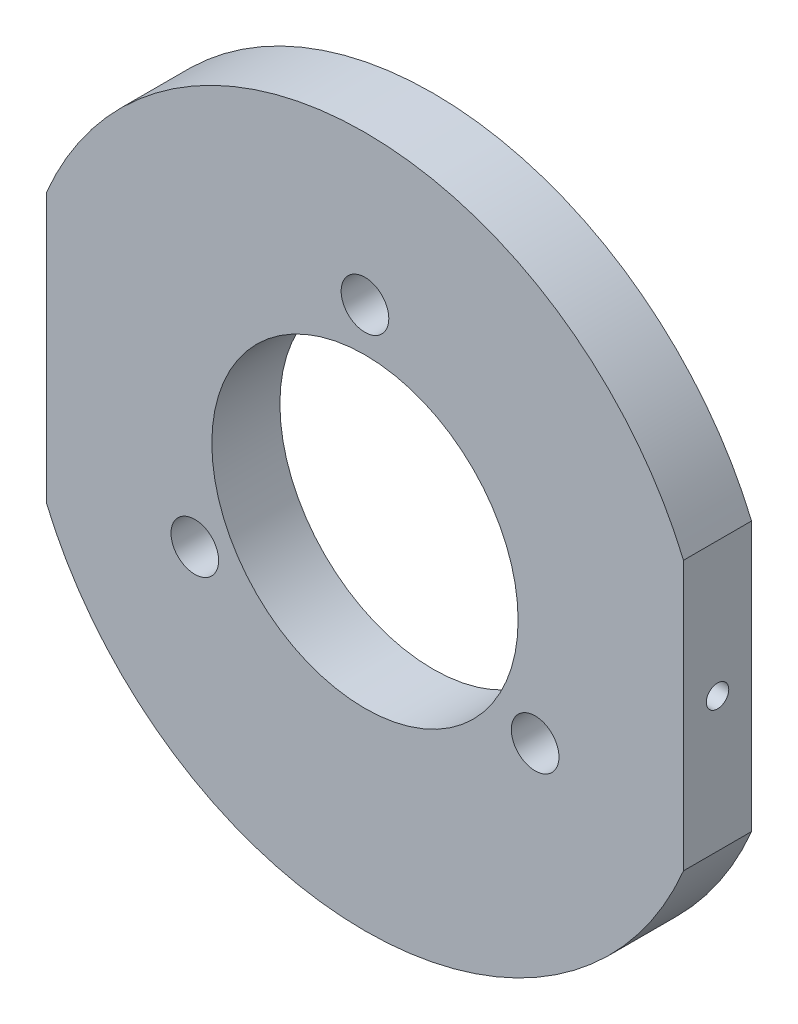
ISO-10303-21;
HEADER;
FILE_DESCRIPTION(('STEP AP214'),'2;1');
FILE_NAME('part.step','',(''),(''),'','','');
FILE_SCHEMA(('AUTOMOTIVE_DESIGN { 1 0 10303 214 1 1 1 1 }'));
ENDSEC;
DATA;
#1=APPLICATION_CONTEXT('core data for automotive mechanical design processes');
#2=APPLICATION_PROTOCOL_DEFINITION('international standard','automotive_design',2000,#1);
#3=PRODUCT_CONTEXT('',#1,'mechanical');
#4=PRODUCT('Part','Part','',(#3));
#5=PRODUCT_RELATED_PRODUCT_CATEGORY('part','',(#4));
#6=PRODUCT_DEFINITION_FORMATION('','',#4);
#7=PRODUCT_DEFINITION_CONTEXT('part definition',#1,'design');
#8=PRODUCT_DEFINITION('design','',#6,#7);
#9=PRODUCT_DEFINITION_SHAPE('','',#8);
#10=(LENGTH_UNIT() NAMED_UNIT(*) SI_UNIT(.MILLI.,.METRE.));
#11=(NAMED_UNIT(*) PLANE_ANGLE_UNIT() SI_UNIT($,.RADIAN.));
#12=(NAMED_UNIT(*) SI_UNIT($,.STERADIAN.) SOLID_ANGLE_UNIT());
#13=UNCERTAINTY_MEASURE_WITH_UNIT(LENGTH_MEASURE(1.E-05),#10,'distance_accuracy_value','');
#14=(GEOMETRIC_REPRESENTATION_CONTEXT(3) GLOBAL_UNCERTAINTY_ASSIGNED_CONTEXT((#13)) GLOBAL_UNIT_ASSIGNED_CONTEXT((#10,
#11,#12)) REPRESENTATION_CONTEXT('',''));
#15=CARTESIAN_POINT('',(0.,0.,0.));
#16=DIRECTION('',(0.,0.,1.));
#17=DIRECTION('',(1.,0.,0.));
#18=AXIS2_PLACEMENT_3D('',#15,#16,#17);
#19=CARTESIAN_POINT('',(46.8,3.28708694398901E-13,10.));
#20=DIRECTION('',(1.,0.,0.));
#21=DIRECTION('',(0.,1.,0.));
#22=AXIS2_PLACEMENT_3D('',#19,#20,#21);
#23=PLANE('',#22);
#24=CARTESIAN_POINT('',(46.8,3.30443417874877E-13,5.));
#25=DIRECTION('',(1.,0.,0.));
#26=DIRECTION('',(0.,0.,-1.));
#27=AXIS2_PLACEMENT_3D('',#24,#25,#26);
#28=CIRCLE('',#27,1.64999999999999);
#29=CARTESIAN_POINT('',(46.8,3.30443417874877E-13,3.35000000000001));
#30=VERTEX_POINT('',#29);
#31=EDGE_CURVE('E110',#30,#30,#28,.T.);
#32=ORIENTED_EDGE('',*,*,#31,.F.);
#33=EDGE_LOOP('',(#32));
#34=FACE_BOUND('',#33,.T.);
#35=DIRECTION('',(0.,-1.,0.));
#36=VECTOR('',#35,1.);
#37=CARTESIAN_POINT('',(46.8,3.28708694398901E-13,0.));
#38=LINE('',#37,#36);
#39=CARTESIAN_POINT('',(46.7999999999999,19.7585424563659,0.));
#40=VERTEX_POINT('',#39);
#41=CARTESIAN_POINT('',(46.8000000000001,-19.7585424563652,0.));
#42=VERTEX_POINT('',#41);
#43=EDGE_CURVE('E158',#40,#42,#38,.T.);
#44=ORIENTED_EDGE('',*,*,#43,.F.);
#45=DIRECTION('',(0.,0.,-1.));
#46=VECTOR('',#45,1.);
#47=CARTESIAN_POINT('',(46.7999999999999,19.7585424563659,10.));
#48=LINE('',#47,#46);
#49=CARTESIAN_POINT('',(46.7999999999999,19.7585424563659,10.));
#50=VERTEX_POINT('',#49);
#51=EDGE_CURVE('E11',#50,#40,#48,.T.);
#52=ORIENTED_EDGE('',*,*,#51,.F.);
#53=DIRECTION('',(0.,-1.,0.));
#54=VECTOR('',#53,1.);
#55=CARTESIAN_POINT('',(46.8,3.28708694398901E-13,10.));
#56=LINE('',#55,#54);
#57=CARTESIAN_POINT('',(46.8000000000001,-19.7585424563652,10.));
#58=VERTEX_POINT('',#57);
#59=EDGE_CURVE('E130',#50,#58,#56,.T.);
#60=ORIENTED_EDGE('',*,*,#59,.T.);
#61=DIRECTION('',(0.,0.,-1.));
#62=VECTOR('',#61,1.);
#63=CARTESIAN_POINT('',(46.8000000000001,-19.7585424563652,10.));
#64=LINE('',#63,#62);
#65=EDGE_CURVE('E88',#58,#42,#64,.T.);
#66=ORIENTED_EDGE('',*,*,#65,.T.);
#67=EDGE_LOOP('',(#44,#52,#60,#66));
#68=FACE_BOUND('',#67,.T.);
#69=ADVANCED_FACE('F47',(#34,#68),#23,.T.);
#70=CARTESIAN_POINT('',(0.,0.,10.));
#71=DIRECTION('',(0.,0.,-1.));
#72=DIRECTION('',(-1.,0.,0.));
#73=AXIS2_PLACEMENT_3D('',#70,#71,#72);
#74=CYLINDRICAL_SURFACE('',#73,50.8);
#75=CARTESIAN_POINT('',(0.,0.,0.));
#76=DIRECTION('',(0.,0.,1.));
#77=DIRECTION('',(1.,0.,0.));
#78=AXIS2_PLACEMENT_3D('',#75,#76,#77);
#79=CIRCLE('',#78,50.8);
#80=CARTESIAN_POINT('',(-46.8,19.7585424563656,0.));
#81=VERTEX_POINT('',#80);
#82=EDGE_CURVE('E161',#40,#81,#79,.T.);
#83=ORIENTED_EDGE('',*,*,#82,.T.);
#84=DIRECTION('',(0.,0.,-1.));
#85=VECTOR('',#84,1.);
#86=CARTESIAN_POINT('',(-46.8,19.7585424563656,10.));
#87=LINE('',#86,#85);
#88=CARTESIAN_POINT('',(-46.8,19.7585424563656,10.));
#89=VERTEX_POINT('',#88);
#90=EDGE_CURVE('E57',#89,#81,#87,.T.);
#91=ORIENTED_EDGE('',*,*,#90,.F.);
#92=CARTESIAN_POINT('',(0.,0.,10.));
#93=DIRECTION('',(0.,0.,1.));
#94=DIRECTION('',(1.,0.,0.));
#95=AXIS2_PLACEMENT_3D('',#92,#93,#94);
#96=CIRCLE('',#95,50.8);
#97=EDGE_CURVE('E134',#50,#89,#96,.T.);
#98=ORIENTED_EDGE('',*,*,#97,.F.);
#99=ORIENTED_EDGE('',*,*,#51,.T.);
#100=EDGE_LOOP('',(#83,#91,#98,#99));
#101=FACE_BOUND('',#100,.T.);
#102=ADVANCED_FACE('F195',(#101),#74,.T.);
#103=CARTESIAN_POINT('',(-46.8,0.,10.));
#104=DIRECTION('',(1.,0.,0.));
#105=DIRECTION('',(0.,0.,-1.));
#106=AXIS2_PLACEMENT_3D('',#103,#104,#105);
#107=PLANE('',#106);
#108=CARTESIAN_POINT('',(-46.8,3.30443417874877E-13,5.));
#109=DIRECTION('',(-1.,0.,0.));
#110=DIRECTION('',(0.,0.,1.));
#111=AXIS2_PLACEMENT_3D('',#108,#109,#110);
#112=CIRCLE('',#111,1.64999999999999);
#113=CARTESIAN_POINT('',(-46.8,3.30443417874877E-13,6.64999999999999));
#114=VERTEX_POINT('',#113);
#115=EDGE_CURVE('E111',#114,#114,#112,.T.);
#116=ORIENTED_EDGE('',*,*,#115,.F.);
#117=EDGE_LOOP('',(#116));
#118=FACE_BOUND('',#117,.T.);
#119=DIRECTION('',(0.,-1.,0.));
#120=VECTOR('',#119,1.);
#121=CARTESIAN_POINT('',(-46.8,0.,0.));
#122=LINE('',#121,#120);
#123=CARTESIAN_POINT('',(-46.8,-19.7585424563656,0.));
#124=VERTEX_POINT('',#123);
#125=EDGE_CURVE('E165',#81,#124,#122,.T.);
#126=ORIENTED_EDGE('',*,*,#125,.T.);
#127=DIRECTION('',(0.,0.,-1.));
#128=VECTOR('',#127,1.);
#129=CARTESIAN_POINT('',(-46.8,-19.7585424563656,10.));
#130=LINE('',#129,#128);
#131=CARTESIAN_POINT('',(-46.8,-19.7585424563656,10.));
#132=VERTEX_POINT('',#131);
#133=EDGE_CURVE('E184',#132,#124,#130,.T.);
#134=ORIENTED_EDGE('',*,*,#133,.F.);
#135=DIRECTION('',(0.,-1.,0.));
#136=VECTOR('',#135,1.);
#137=CARTESIAN_POINT('',(-46.8,0.,10.));
#138=LINE('',#137,#136);
#139=EDGE_CURVE('E138',#89,#132,#138,.T.);
#140=ORIENTED_EDGE('',*,*,#139,.F.);
#141=ORIENTED_EDGE('',*,*,#90,.T.);
#142=EDGE_LOOP('',(#126,#134,#140,#141));
#143=FACE_BOUND('',#142,.T.);
#144=ADVANCED_FACE('F191',(#118,#143),#107,.F.);
#145=CARTESIAN_POINT('',(25.,-14.4337567297406,10.));
#146=DIRECTION('',(0.,0.,-1.));
#147=DIRECTION('',(-1.,0.,0.));
#148=AXIS2_PLACEMENT_3D('',#145,#146,#147);
#149=CYLINDRICAL_SURFACE('',#148,3.5);
#150=CARTESIAN_POINT('',(25.,-14.4337567297406,10.));
#151=DIRECTION('',(0.,0.,1.));
#152=DIRECTION('',(1.,0.,0.));
#153=AXIS2_PLACEMENT_3D('',#150,#151,#152);
#154=CIRCLE('',#153,3.5);
#155=CARTESIAN_POINT('',(28.5,-14.4337567297406,10.));
#156=VERTEX_POINT('',#155);
#157=EDGE_CURVE('E147',#156,#156,#154,.T.);
#158=ORIENTED_EDGE('',*,*,#157,.T.);
#159=EDGE_LOOP('',(#158));
#160=FACE_BOUND('',#159,.T.);
#161=CARTESIAN_POINT('',(25.,-14.4337567297406,0.));
#162=DIRECTION('',(0.,0.,1.));
#163=DIRECTION('',(1.,0.,0.));
#164=AXIS2_PLACEMENT_3D('',#161,#162,#163);
#165=CIRCLE('',#164,3.5);
#166=CARTESIAN_POINT('',(28.5,-14.4337567297406,0.));
#167=VERTEX_POINT('',#166);
#168=EDGE_CURVE('E175',#167,#167,#165,.T.);
#169=ORIENTED_EDGE('',*,*,#168,.F.);
#170=EDGE_LOOP('',(#169));
#171=FACE_BOUND('',#170,.T.);
#172=ADVANCED_FACE('F208',(#160,#171),#149,.F.);
#173=CARTESIAN_POINT('',(0.,0.,10.));
#174=DIRECTION('',(0.,0.,-1.));
#175=DIRECTION('',(-1.,0.,0.));
#176=AXIS2_PLACEMENT_3D('',#173,#174,#175);
#177=CYLINDRICAL_SURFACE('',#176,22.5);
#178=CARTESIAN_POINT('',(0.,0.,10.));
#179=DIRECTION('',(0.,0.,1.));
#180=DIRECTION('',(1.,0.,0.));
#181=AXIS2_PLACEMENT_3D('',#178,#179,#180);
#182=CIRCLE('',#181,22.5);
#183=CARTESIAN_POINT('',(22.5,0.,10.));
#184=VERTEX_POINT('',#183);
#185=EDGE_CURVE('E143',#184,#184,#182,.T.);
#186=ORIENTED_EDGE('',*,*,#185,.T.);
#187=EDGE_LOOP('',(#186));
#188=FACE_BOUND('',#187,.T.);
#189=CARTESIAN_POINT('',(0.,0.,0.));
#190=DIRECTION('',(0.,0.,1.));
#191=DIRECTION('',(1.,0.,0.));
#192=AXIS2_PLACEMENT_3D('',#189,#190,#191);
#193=CIRCLE('',#192,22.5);
#194=CARTESIAN_POINT('',(22.5,0.,0.));
#195=VERTEX_POINT('',#194);
#196=EDGE_CURVE('E171',#195,#195,#193,.T.);
#197=ORIENTED_EDGE('',*,*,#196,.F.);
#198=EDGE_LOOP('',(#197));
#199=FACE_BOUND('',#198,.T.);
#200=ADVANCED_FACE('F213',(#188,#199),#177,.F.);
#201=CARTESIAN_POINT('',(0.,0.,10.));
#202=DIRECTION('',(0.,0.,-1.));
#203=DIRECTION('',(-1.,0.,0.));
#204=AXIS2_PLACEMENT_3D('',#201,#202,#203);
#205=CYLINDRICAL_SURFACE('',#204,50.8);
#206=CARTESIAN_POINT('',(0.,0.,0.));
#207=DIRECTION('',(0.,0.,1.));
#208=DIRECTION('',(1.,0.,0.));
#209=AXIS2_PLACEMENT_3D('',#206,#207,#208);
#210=CIRCLE('',#209,50.8);
#211=EDGE_CURVE('E81',#124,#42,#210,.T.);
#212=ORIENTED_EDGE('',*,*,#211,.T.);
#213=ORIENTED_EDGE('',*,*,#65,.F.);
#214=CARTESIAN_POINT('',(0.,0.,10.));
#215=DIRECTION('',(0.,0.,1.));
#216=DIRECTION('',(1.,0.,0.));
#217=AXIS2_PLACEMENT_3D('',#214,#215,#216);
#218=CIRCLE('',#217,50.8);
#219=EDGE_CURVE('E65',#132,#58,#218,.T.);
#220=ORIENTED_EDGE('',*,*,#219,.F.);
#221=ORIENTED_EDGE('',*,*,#133,.T.);
#222=EDGE_LOOP('',(#212,#213,#220,#221));
#223=FACE_BOUND('',#222,.T.);
#224=ADVANCED_FACE('F210',(#223),#205,.T.);
#225=CARTESIAN_POINT('',(0.,28.8675134594813,10.));
#226=DIRECTION('',(0.,0.,-1.));
#227=DIRECTION('',(-1.,0.,0.));
#228=AXIS2_PLACEMENT_3D('',#225,#226,#227);
#229=CYLINDRICAL_SURFACE('',#228,3.5);
#230=CARTESIAN_POINT('',(0.,28.8675134594813,10.));
#231=DIRECTION('',(0.,0.,1.));
#232=DIRECTION('',(1.,0.,0.));
#233=AXIS2_PLACEMENT_3D('',#230,#231,#232);
#234=CIRCLE('',#233,3.5);
#235=CARTESIAN_POINT('',(3.5,28.8675134594813,10.));
#236=VERTEX_POINT('',#235);
#237=EDGE_CURVE('E126',#236,#236,#234,.T.);
#238=ORIENTED_EDGE('',*,*,#237,.T.);
#239=EDGE_LOOP('',(#238));
#240=FACE_BOUND('',#239,.T.);
#241=CARTESIAN_POINT('',(0.,28.8675134594813,0.));
#242=DIRECTION('',(0.,0.,1.));
#243=DIRECTION('',(1.,0.,0.));
#244=AXIS2_PLACEMENT_3D('',#241,#242,#243);
#245=CIRCLE('',#244,3.5);
#246=CARTESIAN_POINT('',(3.5,28.8675134594813,0.));
#247=VERTEX_POINT('',#246);
#248=EDGE_CURVE('E125',#247,#247,#245,.T.);
#249=ORIENTED_EDGE('',*,*,#248,.F.);
#250=EDGE_LOOP('',(#249));
#251=FACE_BOUND('',#250,.T.);
#252=ADVANCED_FACE('F49',(#240,#251),#229,.F.);
#253=CARTESIAN_POINT('',(-25.,-14.4337567297406,10.));
#254=DIRECTION('',(0.,0.,-1.));
#255=DIRECTION('',(-1.,0.,0.));
#256=AXIS2_PLACEMENT_3D('',#253,#254,#255);
#257=CYLINDRICAL_SURFACE('',#256,3.5);
#258=CARTESIAN_POINT('',(-25.,-14.4337567297406,10.));
#259=DIRECTION('',(0.,0.,1.));
#260=DIRECTION('',(1.,0.,0.));
#261=AXIS2_PLACEMENT_3D('',#258,#259,#260);
#262=CIRCLE('',#261,3.5);
#263=CARTESIAN_POINT('',(-21.5,-14.4337567297406,10.));
#264=VERTEX_POINT('',#263);
#265=EDGE_CURVE('E151',#264,#264,#262,.T.);
#266=ORIENTED_EDGE('',*,*,#265,.T.);
#267=EDGE_LOOP('',(#266));
#268=FACE_BOUND('',#267,.T.);
#269=CARTESIAN_POINT('',(-25.,-14.4337567297406,0.));
#270=DIRECTION('',(0.,0.,1.));
#271=DIRECTION('',(1.,0.,0.));
#272=AXIS2_PLACEMENT_3D('',#269,#270,#271);
#273=CIRCLE('',#272,3.5);
#274=CARTESIAN_POINT('',(-21.5,-14.4337567297406,0.));
#275=VERTEX_POINT('',#274);
#276=EDGE_CURVE('E131',#275,#275,#273,.T.);
#277=ORIENTED_EDGE('',*,*,#276,.F.);
#278=EDGE_LOOP('',(#277));
#279=FACE_BOUND('',#278,.T.);
#280=ADVANCED_FACE('F221',(#268,#279),#257,.F.);
#281=CARTESIAN_POINT('',(0.,0.,10.));
#282=DIRECTION('',(0.,0.,1.));
#283=DIRECTION('',(1.,0.,0.));
#284=AXIS2_PLACEMENT_3D('',#281,#282,#283);
#285=PLANE('',#284);
#286=ORIENTED_EDGE('',*,*,#237,.F.);
#287=EDGE_LOOP('',(#286));
#288=FACE_BOUND('',#287,.T.);
#289=ORIENTED_EDGE('',*,*,#59,.F.);
#290=ORIENTED_EDGE('',*,*,#97,.T.);
#291=ORIENTED_EDGE('',*,*,#139,.T.);
#292=ORIENTED_EDGE('',*,*,#219,.T.);
#293=EDGE_LOOP('',(#289,#290,#291,#292));
#294=FACE_BOUND('',#293,.T.);
#295=ORIENTED_EDGE('',*,*,#185,.F.);
#296=EDGE_LOOP('',(#295));
#297=FACE_BOUND('',#296,.T.);
#298=ORIENTED_EDGE('',*,*,#157,.F.);
#299=EDGE_LOOP('',(#298));
#300=FACE_BOUND('',#299,.T.);
#301=ORIENTED_EDGE('',*,*,#265,.F.);
#302=EDGE_LOOP('',(#301));
#303=FACE_BOUND('',#302,.T.);
#304=ADVANCED_FACE('F224',(#288,#294,#297,#300,#303),#285,.T.);
#305=CARTESIAN_POINT('',(0.,0.,0.));
#306=DIRECTION('',(0.,0.,1.));
#307=DIRECTION('',(1.,0.,0.));
#308=AXIS2_PLACEMENT_3D('',#305,#306,#307);
#309=PLANE('',#308);
#310=ORIENTED_EDGE('',*,*,#248,.T.);
#311=EDGE_LOOP('',(#310));
#312=FACE_BOUND('',#311,.T.);
#313=ORIENTED_EDGE('',*,*,#43,.T.);
#314=ORIENTED_EDGE('',*,*,#211,.F.);
#315=ORIENTED_EDGE('',*,*,#125,.F.);
#316=ORIENTED_EDGE('',*,*,#82,.F.);
#317=EDGE_LOOP('',(#313,#314,#315,#316));
#318=FACE_BOUND('',#317,.T.);
#319=ORIENTED_EDGE('',*,*,#196,.T.);
#320=EDGE_LOOP('',(#319));
#321=FACE_BOUND('',#320,.T.);
#322=ORIENTED_EDGE('',*,*,#168,.T.);
#323=EDGE_LOOP('',(#322));
#324=FACE_BOUND('',#323,.T.);
#325=ORIENTED_EDGE('',*,*,#276,.T.);
#326=EDGE_LOOP('',(#325));
#327=FACE_BOUND('',#326,.T.);
#328=ADVANCED_FACE('F196',(#312,#318,#321,#324,#327),#309,.F.);
#329=CARTESIAN_POINT('',(31.8,3.30443417874877E-13,5.));
#330=DIRECTION('',(1.,0.,0.));
#331=DIRECTION('',(0.,0.,-1.));
#332=AXIS2_PLACEMENT_3D('',#329,#330,#331);
#333=CONICAL_SURFACE('',#332,1.65,1.02974425867665);
#334=CARTESIAN_POINT('',(30.8085799786045,3.26526649606273E-13,5.));
#335=VERTEX_POINT('',#334);
#336=VERTEX_LOOP('',#335);
#337=FACE_BOUND('',#336,.T.);
#338=CARTESIAN_POINT('',(31.8,3.30443417874877E-13,5.));
#339=DIRECTION('',(1.,0.,0.));
#340=DIRECTION('',(0.,0.,-1.));
#341=AXIS2_PLACEMENT_3D('',#338,#339,#340);
#342=CIRCLE('',#341,1.65);
#343=CARTESIAN_POINT('',(31.8,3.30443417874877E-13,3.35));
#344=VERTEX_POINT('',#343);
#345=EDGE_CURVE('E117',#344,#344,#342,.T.);
#346=ORIENTED_EDGE('',*,*,#345,.T.);
#347=EDGE_LOOP('',(#346));
#348=FACE_BOUND('',#347,.T.);
#349=ADVANCED_FACE('F228',(#337,#348),#333,.F.);
#350=CARTESIAN_POINT('',(46.8,3.30443417874877E-13,5.));
#351=DIRECTION('',(1.,0.,0.));
#352=DIRECTION('',(0.,0.,-1.));
#353=AXIS2_PLACEMENT_3D('',#350,#351,#352);
#354=CYLINDRICAL_SURFACE('',#353,1.64999999999999);
#355=ORIENTED_EDGE('',*,*,#345,.F.);
#356=EDGE_LOOP('',(#355));
#357=FACE_BOUND('',#356,.T.);
#358=ORIENTED_EDGE('',*,*,#31,.T.);
#359=EDGE_LOOP('',(#358));
#360=FACE_BOUND('',#359,.T.);
#361=ADVANCED_FACE('F103',(#357,#360),#354,.F.);
#362=CARTESIAN_POINT('',(-31.8,3.30443417874877E-13,5.));
#363=DIRECTION('',(-1.,0.,0.));
#364=DIRECTION('',(0.,0.,1.));
#365=AXIS2_PLACEMENT_3D('',#362,#363,#364);
#366=CONICAL_SURFACE('',#365,1.65,1.02974425867665);
#367=CARTESIAN_POINT('',(-30.8085799786045,3.26526649606273E-13,5.));
#368=VERTEX_POINT('',#367);
#369=VERTEX_LOOP('',#368);
#370=FACE_BOUND('',#369,.T.);
#371=CARTESIAN_POINT('',(-31.8,3.30443417874877E-13,5.));
#372=DIRECTION('',(-1.,0.,0.));
#373=DIRECTION('',(0.,0.,1.));
#374=AXIS2_PLACEMENT_3D('',#371,#372,#373);
#375=CIRCLE('',#374,1.65);
#376=CARTESIAN_POINT('',(-31.8,3.30443417874877E-13,6.65));
#377=VERTEX_POINT('',#376);
#378=EDGE_CURVE('E107',#377,#377,#375,.T.);
#379=ORIENTED_EDGE('',*,*,#378,.T.);
#380=EDGE_LOOP('',(#379));
#381=FACE_BOUND('',#380,.T.);
#382=ADVANCED_FACE('F99',(#370,#381),#366,.F.);
#383=CARTESIAN_POINT('',(-46.8,3.30443417874877E-13,5.));
#384=DIRECTION('',(-1.,0.,0.));
#385=DIRECTION('',(0.,0.,1.));
#386=AXIS2_PLACEMENT_3D('',#383,#384,#385);
#387=CYLINDRICAL_SURFACE('',#386,1.64999999999999);
#388=ORIENTED_EDGE('',*,*,#378,.F.);
#389=EDGE_LOOP('',(#388));
#390=FACE_BOUND('',#389,.T.);
#391=ORIENTED_EDGE('',*,*,#115,.T.);
#392=EDGE_LOOP('',(#391));
#393=FACE_BOUND('',#392,.T.);
#394=ADVANCED_FACE('F102',(#390,#393),#387,.F.);
#395=CLOSED_SHELL('',(#69,#102,#144,#172,#200,#224,#252,#280,#304,#328,#349,#361,#382,#394));
#396=MANIFOLD_SOLID_BREP('B2',#395);
#397=ADVANCED_BREP_SHAPE_REPRESENTATION('',(#18,#396),#14);
#398=SHAPE_DEFINITION_REPRESENTATION(#9,#397);
ENDSEC;
END-ISO-10303-21;
